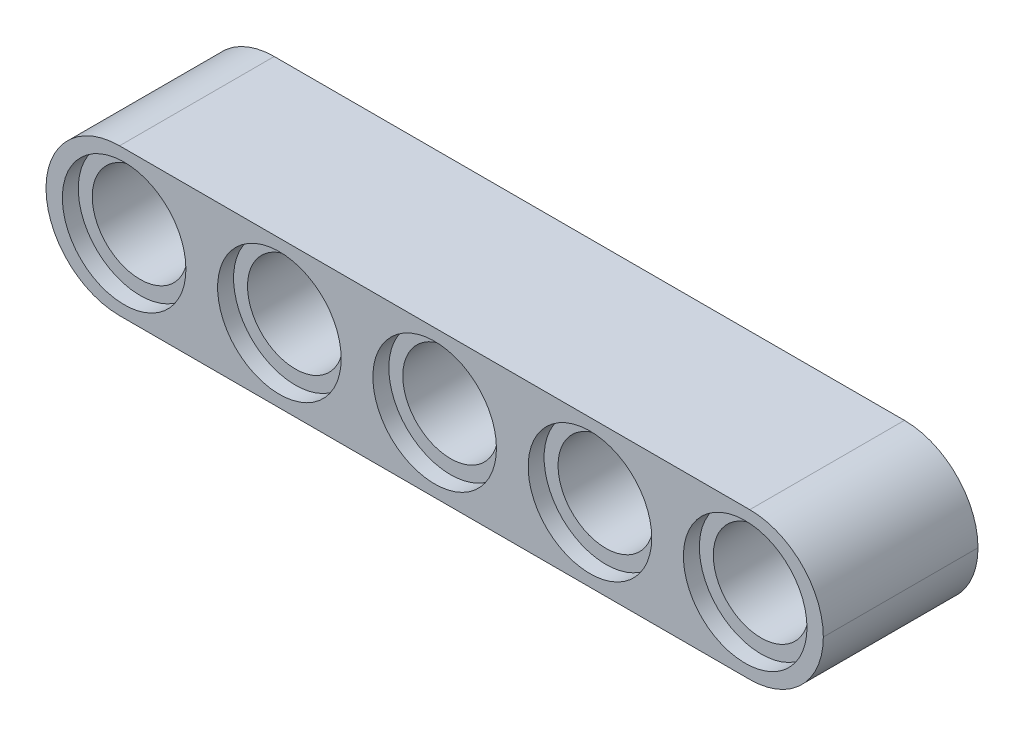
ISO-10303-21;
HEADER;
FILE_DESCRIPTION(('STEP AP214'),'2;1');
FILE_NAME('part.step','',(''),(''),'','','');
FILE_SCHEMA(('AUTOMOTIVE_DESIGN { 1 0 10303 214 1 1 1 1 }'));
ENDSEC;
DATA;
#1=APPLICATION_CONTEXT('core data for automotive mechanical design processes');
#2=APPLICATION_PROTOCOL_DEFINITION('international standard','automotive_design',2000,#1);
#3=PRODUCT_CONTEXT('',#1,'mechanical');
#4=PRODUCT('Part','Part','',(#3));
#5=PRODUCT_RELATED_PRODUCT_CATEGORY('part','',(#4));
#6=PRODUCT_DEFINITION_FORMATION('','',#4);
#7=PRODUCT_DEFINITION_CONTEXT('part definition',#1,'design');
#8=PRODUCT_DEFINITION('design','',#6,#7);
#9=PRODUCT_DEFINITION_SHAPE('','',#8);
#10=(LENGTH_UNIT() NAMED_UNIT(*) SI_UNIT(.MILLI.,.METRE.));
#11=(NAMED_UNIT(*) PLANE_ANGLE_UNIT() SI_UNIT($,.RADIAN.));
#12=(NAMED_UNIT(*) SI_UNIT($,.STERADIAN.) SOLID_ANGLE_UNIT());
#13=UNCERTAINTY_MEASURE_WITH_UNIT(LENGTH_MEASURE(1.E-05),#10,'distance_accuracy_value','');
#14=(GEOMETRIC_REPRESENTATION_CONTEXT(3) GLOBAL_UNCERTAINTY_ASSIGNED_CONTEXT((#13)) GLOBAL_UNIT_ASSIGNED_CONTEXT((#10,
#11,#12)) REPRESENTATION_CONTEXT('',''));
#15=CARTESIAN_POINT('',(0.,0.,0.));
#16=DIRECTION('',(0.,0.,1.));
#17=DIRECTION('',(1.,0.,0.));
#18=AXIS2_PLACEMENT_3D('',#15,#16,#17);
#19=CARTESIAN_POINT('',(35.31,3.69,7.76));
#20=DIRECTION('',(0.,0.,1.));
#21=DIRECTION('',(1.,0.,0.));
#22=AXIS2_PLACEMENT_3D('',#19,#20,#21);
#23=CYLINDRICAL_SURFACE('',#22,3.69);
#24=DIRECTION('',(0.,0.,1.));
#25=VECTOR('',#24,1.);
#26=CARTESIAN_POINT('',(35.31,0.,7.76));
#27=LINE('',#26,#25);
#28=CARTESIAN_POINT('',(35.31,0.,0.));
#29=VERTEX_POINT('',#28);
#30=CARTESIAN_POINT('',(35.31,0.,7.76));
#31=VERTEX_POINT('',#30);
#32=EDGE_CURVE('E134',#29,#31,#27,.T.);
#33=ORIENTED_EDGE('',*,*,#32,.F.);
#34=CARTESIAN_POINT('',(35.31,3.69,0.));
#35=DIRECTION('',(0.,0.,-1.));
#36=DIRECTION('',(-1.,0.,0.));
#37=AXIS2_PLACEMENT_3D('',#34,#35,#36);
#38=CIRCLE('',#37,3.69);
#39=CARTESIAN_POINT('',(39.,3.69,0.));
#40=VERTEX_POINT('',#39);
#41=EDGE_CURVE('E44',#40,#29,#38,.T.);
#42=ORIENTED_EDGE('',*,*,#41,.F.);
#43=DIRECTION('',(0.,0.,1.));
#44=VECTOR('',#43,1.);
#45=CARTESIAN_POINT('',(39.,3.69,7.76));
#46=LINE('',#45,#44);
#47=CARTESIAN_POINT('',(39.,3.69,7.76));
#48=VERTEX_POINT('',#47);
#49=EDGE_CURVE('E127',#40,#48,#46,.T.);
#50=ORIENTED_EDGE('',*,*,#49,.T.);
#51=CARTESIAN_POINT('',(35.31,3.69,7.76));
#52=DIRECTION('',(0.,0.,-1.));
#53=DIRECTION('',(-1.,0.,0.));
#54=AXIS2_PLACEMENT_3D('',#51,#52,#53);
#55=CIRCLE('',#54,3.69);
#56=EDGE_CURVE('E12',#31,#48,#55,.F.);
#57=ORIENTED_EDGE('',*,*,#56,.F.);
#58=EDGE_LOOP('',(#33,#42,#50,#57));
#59=FACE_BOUND('',#58,.T.);
#60=ADVANCED_FACE('F37',(#59),#23,.T.);
#61=CARTESIAN_POINT('',(35.31,3.69,7.76));
#62=DIRECTION('',(0.,0.,1.));
#63=DIRECTION('',(1.,0.,0.));
#64=AXIS2_PLACEMENT_3D('',#61,#62,#63);
#65=CYLINDRICAL_SURFACE('',#64,3.69);
#66=ORIENTED_EDGE('',*,*,#49,.F.);
#67=CARTESIAN_POINT('',(35.31,3.69,0.));
#68=DIRECTION('',(0.,0.,-1.));
#69=DIRECTION('',(-1.,0.,0.));
#70=AXIS2_PLACEMENT_3D('',#67,#68,#69);
#71=CIRCLE('',#70,3.69);
#72=CARTESIAN_POINT('',(35.31,7.38,0.));
#73=VERTEX_POINT('',#72);
#74=EDGE_CURVE('E130',#73,#40,#71,.T.);
#75=ORIENTED_EDGE('',*,*,#74,.F.);
#76=DIRECTION('',(0.,0.,1.));
#77=VECTOR('',#76,1.);
#78=CARTESIAN_POINT('',(35.31,7.38,7.76));
#79=LINE('',#78,#77);
#80=CARTESIAN_POINT('',(35.31,7.38,7.76));
#81=VERTEX_POINT('',#80);
#82=EDGE_CURVE('E95',#81,#73,#79,.F.);
#83=ORIENTED_EDGE('',*,*,#82,.F.);
#84=CARTESIAN_POINT('',(35.31,3.69,7.76));
#85=DIRECTION('',(0.,0.,-1.));
#86=DIRECTION('',(-1.,0.,0.));
#87=AXIS2_PLACEMENT_3D('',#84,#85,#86);
#88=CIRCLE('',#87,3.69);
#89=EDGE_CURVE('E132',#48,#81,#88,.F.);
#90=ORIENTED_EDGE('',*,*,#89,.F.);
#91=EDGE_LOOP('',(#66,#75,#83,#90));
#92=FACE_BOUND('',#91,.T.);
#93=ADVANCED_FACE('F253',(#92),#65,.T.);
#94=CARTESIAN_POINT('',(3.69,3.69,7.76));
#95=DIRECTION('',(0.,0.,-1.));
#96=DIRECTION('',(-1.,0.,0.));
#97=AXIS2_PLACEMENT_3D('',#94,#95,#96);
#98=CYLINDRICAL_SURFACE('',#97,3.69);
#99=DIRECTION('',(0.,0.,-1.));
#100=VECTOR('',#99,1.);
#101=CARTESIAN_POINT('',(3.69,0.,7.76));
#102=LINE('',#101,#100);
#103=CARTESIAN_POINT('',(3.69,0.,7.76));
#104=VERTEX_POINT('',#103);
#105=CARTESIAN_POINT('',(3.69,0.,0.));
#106=VERTEX_POINT('',#105);
#107=EDGE_CURVE('E121',#104,#106,#102,.T.);
#108=ORIENTED_EDGE('',*,*,#107,.F.);
#109=CARTESIAN_POINT('',(3.69,3.69,7.76));
#110=DIRECTION('',(0.,0.,-1.));
#111=DIRECTION('',(-1.,0.,0.));
#112=AXIS2_PLACEMENT_3D('',#109,#110,#111);
#113=CIRCLE('',#112,3.69);
#114=CARTESIAN_POINT('',(0.,3.69,7.76));
#115=VERTEX_POINT('',#114);
#116=EDGE_CURVE('E124',#115,#104,#113,.F.);
#117=ORIENTED_EDGE('',*,*,#116,.F.);
#118=DIRECTION('',(0.,0.,1.));
#119=VECTOR('',#118,1.);
#120=CARTESIAN_POINT('',(0.,3.69,7.76));
#121=LINE('',#120,#119);
#122=CARTESIAN_POINT('',(0.,3.69,0.));
#123=VERTEX_POINT('',#122);
#124=EDGE_CURVE('E107',#115,#123,#121,.F.);
#125=ORIENTED_EDGE('',*,*,#124,.T.);
#126=CARTESIAN_POINT('',(3.69,3.69,0.));
#127=DIRECTION('',(0.,0.,-1.));
#128=DIRECTION('',(-1.,0.,0.));
#129=AXIS2_PLACEMENT_3D('',#126,#127,#128);
#130=CIRCLE('',#129,3.69);
#131=EDGE_CURVE('E102',#106,#123,#130,.T.);
#132=ORIENTED_EDGE('',*,*,#131,.F.);
#133=EDGE_LOOP('',(#108,#117,#125,#132));
#134=FACE_BOUND('',#133,.T.);
#135=ADVANCED_FACE('F257',(#134),#98,.T.);
#136=CARTESIAN_POINT('',(3.69,3.69,7.76));
#137=DIRECTION('',(0.,0.,1.));
#138=DIRECTION('',(1.,0.,0.));
#139=AXIS2_PLACEMENT_3D('',#136,#137,#138);
#140=CYLINDRICAL_SURFACE('',#139,3.69);
#141=DIRECTION('',(0.,0.,1.));
#142=VECTOR('',#141,1.);
#143=CARTESIAN_POINT('',(3.69,7.38,7.76));
#144=LINE('',#143,#142);
#145=CARTESIAN_POINT('',(3.69,7.38,0.));
#146=VERTEX_POINT('',#145);
#147=CARTESIAN_POINT('',(3.69,7.38,7.76));
#148=VERTEX_POINT('',#147);
#149=EDGE_CURVE('E93',#146,#148,#144,.T.);
#150=ORIENTED_EDGE('',*,*,#149,.F.);
#151=CARTESIAN_POINT('',(3.69,3.69,0.));
#152=DIRECTION('',(0.,0.,-1.));
#153=DIRECTION('',(-1.,0.,0.));
#154=AXIS2_PLACEMENT_3D('',#151,#152,#153);
#155=CIRCLE('',#154,3.69);
#156=EDGE_CURVE('E100',#123,#146,#155,.T.);
#157=ORIENTED_EDGE('',*,*,#156,.F.);
#158=ORIENTED_EDGE('',*,*,#124,.F.);
#159=CARTESIAN_POINT('',(3.69,3.69,7.76));
#160=DIRECTION('',(0.,0.,-1.));
#161=DIRECTION('',(-1.,0.,0.));
#162=AXIS2_PLACEMENT_3D('',#159,#160,#161);
#163=CIRCLE('',#162,3.69);
#164=EDGE_CURVE('E106',#148,#115,#163,.F.);
#165=ORIENTED_EDGE('',*,*,#164,.F.);
#166=EDGE_LOOP('',(#150,#157,#158,#165));
#167=FACE_BOUND('',#166,.T.);
#168=ADVANCED_FACE('F110',(#167),#140,.T.);
#169=CARTESIAN_POINT('',(35.08,3.69,0.));
#170=DIRECTION('',(0.,0.,1.));
#171=DIRECTION('',(1.,0.,0.));
#172=AXIS2_PLACEMENT_3D('',#169,#170,#171);
#173=CYLINDRICAL_SURFACE('',#172,3.1);
#174=CARTESIAN_POINT('',(35.08,3.69,0.));
#175=DIRECTION('',(0.,0.,1.));
#176=DIRECTION('',(1.,0.,0.));
#177=AXIS2_PLACEMENT_3D('',#174,#175,#176);
#178=CIRCLE('',#177,3.1);
#179=CARTESIAN_POINT('',(38.18,3.69,0.));
#180=VERTEX_POINT('',#179);
#181=EDGE_CURVE('E112',#180,#180,#178,.T.);
#182=ORIENTED_EDGE('',*,*,#181,.F.);
#183=EDGE_LOOP('',(#182));
#184=FACE_BOUND('',#183,.T.);
#185=CARTESIAN_POINT('',(35.08,3.69,0.8));
#186=DIRECTION('',(0.,0.,1.));
#187=DIRECTION('',(1.,0.,0.));
#188=AXIS2_PLACEMENT_3D('',#185,#186,#187);
#189=CIRCLE('',#188,3.1);
#190=CARTESIAN_POINT('',(38.18,3.69,0.8));
#191=VERTEX_POINT('',#190);
#192=EDGE_CURVE('E116',#191,#191,#189,.T.);
#193=ORIENTED_EDGE('',*,*,#192,.T.);
#194=EDGE_LOOP('',(#193));
#195=FACE_BOUND('',#194,.T.);
#196=ADVANCED_FACE('F228',(#184,#195),#173,.F.);
#197=CARTESIAN_POINT('',(15.58,0.,0.8));
#198=DIRECTION('',(0.,0.,1.));
#199=DIRECTION('',(1.,0.,0.));
#200=AXIS2_PLACEMENT_3D('',#197,#198,#199);
#201=PLANE('',#200);
#202=ORIENTED_EDGE('',*,*,#192,.F.);
#203=EDGE_LOOP('',(#202));
#204=FACE_BOUND('',#203,.T.);
#205=CARTESIAN_POINT('',(35.08,3.69,0.8));
#206=DIRECTION('',(0.,0.,1.));
#207=DIRECTION('',(1.,0.,0.));
#208=AXIS2_PLACEMENT_3D('',#205,#206,#207);
#209=CIRCLE('',#208,2.4);
#210=CARTESIAN_POINT('',(37.48,3.69,0.8));
#211=VERTEX_POINT('',#210);
#212=EDGE_CURVE('E217',#211,#211,#209,.F.);
#213=ORIENTED_EDGE('',*,*,#212,.F.);
#214=EDGE_LOOP('',(#213));
#215=FACE_BOUND('',#214,.T.);
#216=ADVANCED_FACE('F230',(#204,#215),#201,.F.);
#217=CARTESIAN_POINT('',(15.58,0.,6.95999999999999));
#218=DIRECTION('',(0.,0.,-1.));
#219=DIRECTION('',(-1.,0.,0.));
#220=AXIS2_PLACEMENT_3D('',#217,#218,#219);
#221=PLANE('',#220);
#222=CARTESIAN_POINT('',(35.08,3.69,6.96));
#223=DIRECTION('',(0.,0.,1.));
#224=DIRECTION('',(1.,0.,0.));
#225=AXIS2_PLACEMENT_3D('',#222,#223,#224);
#226=CIRCLE('',#225,3.1);
#227=CARTESIAN_POINT('',(38.18,3.69,6.96));
#228=VERTEX_POINT('',#227);
#229=EDGE_CURVE('E223',#228,#228,#226,.T.);
#230=ORIENTED_EDGE('',*,*,#229,.T.);
#231=EDGE_LOOP('',(#230));
#232=FACE_BOUND('',#231,.T.);
#233=CARTESIAN_POINT('',(35.08,3.69,6.95999999999999));
#234=DIRECTION('',(0.,0.,-1.));
#235=DIRECTION('',(-1.,0.,0.));
#236=AXIS2_PLACEMENT_3D('',#233,#234,#235);
#237=CIRCLE('',#236,2.4);
#238=CARTESIAN_POINT('',(32.68,3.69,6.95999999999999));
#239=VERTEX_POINT('',#238);
#240=EDGE_CURVE('E214',#239,#239,#237,.F.);
#241=ORIENTED_EDGE('',*,*,#240,.F.);
#242=EDGE_LOOP('',(#241));
#243=FACE_BOUND('',#242,.T.);
#244=ADVANCED_FACE('F233',(#232,#243),#221,.F.);
#245=CARTESIAN_POINT('',(35.08,3.69,7.76));
#246=DIRECTION('',(0.,0.,-1.));
#247=DIRECTION('',(-1.,0.,0.));
#248=AXIS2_PLACEMENT_3D('',#245,#246,#247);
#249=CYLINDRICAL_SURFACE('',#248,3.1);
#250=CARTESIAN_POINT('',(35.08,3.69,7.76));
#251=DIRECTION('',(0.,0.,1.));
#252=DIRECTION('',(1.,0.,0.));
#253=AXIS2_PLACEMENT_3D('',#250,#251,#252);
#254=CIRCLE('',#253,3.1);
#255=CARTESIAN_POINT('',(38.18,3.69,7.76));
#256=VERTEX_POINT('',#255);
#257=EDGE_CURVE('E220',#256,#256,#254,.T.);
#258=ORIENTED_EDGE('',*,*,#257,.T.);
#259=EDGE_LOOP('',(#258));
#260=FACE_BOUND('',#259,.T.);
#261=ORIENTED_EDGE('',*,*,#229,.F.);
#262=EDGE_LOOP('',(#261));
#263=FACE_BOUND('',#262,.T.);
#264=ADVANCED_FACE('F240',(#260,#263),#249,.F.);
#265=CARTESIAN_POINT('',(35.08,3.69,0.));
#266=DIRECTION('',(0.,0.,1.));
#267=DIRECTION('',(1.,0.,0.));
#268=AXIS2_PLACEMENT_3D('',#265,#266,#267);
#269=CYLINDRICAL_SURFACE('',#268,2.4);
#270=ORIENTED_EDGE('',*,*,#240,.T.);
#271=EDGE_LOOP('',(#270));
#272=FACE_BOUND('',#271,.T.);
#273=ORIENTED_EDGE('',*,*,#212,.T.);
#274=EDGE_LOOP('',(#273));
#275=FACE_BOUND('',#274,.T.);
#276=ADVANCED_FACE('F237',(#272,#275),#269,.F.);
#277=CARTESIAN_POINT('',(27.29,3.69,0.));
#278=DIRECTION('',(0.,0.,1.));
#279=DIRECTION('',(1.,0.,0.));
#280=AXIS2_PLACEMENT_3D('',#277,#278,#279);
#281=CYLINDRICAL_SURFACE('',#280,3.1);
#282=CARTESIAN_POINT('',(27.29,3.69,0.));
#283=DIRECTION('',(0.,0.,1.));
#284=DIRECTION('',(1.,0.,0.));
#285=AXIS2_PLACEMENT_3D('',#282,#283,#284);
#286=CIRCLE('',#285,3.1);
#287=CARTESIAN_POINT('',(30.39,3.69,0.));
#288=VERTEX_POINT('',#287);
#289=EDGE_CURVE('E211',#288,#288,#286,.T.);
#290=ORIENTED_EDGE('',*,*,#289,.F.);
#291=EDGE_LOOP('',(#290));
#292=FACE_BOUND('',#291,.T.);
#293=CARTESIAN_POINT('',(27.29,3.69,0.8));
#294=DIRECTION('',(0.,0.,1.));
#295=DIRECTION('',(1.,0.,0.));
#296=AXIS2_PLACEMENT_3D('',#293,#294,#295);
#297=CIRCLE('',#296,3.1);
#298=CARTESIAN_POINT('',(30.39,3.69,0.8));
#299=VERTEX_POINT('',#298);
#300=EDGE_CURVE('E208',#299,#299,#297,.T.);
#301=ORIENTED_EDGE('',*,*,#300,.T.);
#302=EDGE_LOOP('',(#301));
#303=FACE_BOUND('',#302,.T.);
#304=ADVANCED_FACE('F239',(#292,#303),#281,.F.);
#305=CARTESIAN_POINT('',(7.79,0.,0.8));
#306=DIRECTION('',(0.,0.,1.));
#307=DIRECTION('',(1.,0.,0.));
#308=AXIS2_PLACEMENT_3D('',#305,#306,#307);
#309=PLANE('',#308);
#310=ORIENTED_EDGE('',*,*,#300,.F.);
#311=EDGE_LOOP('',(#310));
#312=FACE_BOUND('',#311,.T.);
#313=CARTESIAN_POINT('',(27.29,3.69,0.8));
#314=DIRECTION('',(0.,0.,1.));
#315=DIRECTION('',(1.,0.,0.));
#316=AXIS2_PLACEMENT_3D('',#313,#314,#315);
#317=CIRCLE('',#316,2.4);
#318=CARTESIAN_POINT('',(29.69,3.69,0.8));
#319=VERTEX_POINT('',#318);
#320=EDGE_CURVE('E199',#319,#319,#317,.F.);
#321=ORIENTED_EDGE('',*,*,#320,.F.);
#322=EDGE_LOOP('',(#321));
#323=FACE_BOUND('',#322,.T.);
#324=ADVANCED_FACE('F247',(#312,#323),#309,.F.);
#325=CARTESIAN_POINT('',(7.79,0.,6.95999999999999));
#326=DIRECTION('',(0.,0.,-1.));
#327=DIRECTION('',(-1.,0.,0.));
#328=AXIS2_PLACEMENT_3D('',#325,#326,#327);
#329=PLANE('',#328);
#330=CARTESIAN_POINT('',(27.29,3.69,6.96));
#331=DIRECTION('',(0.,0.,1.));
#332=DIRECTION('',(1.,0.,0.));
#333=AXIS2_PLACEMENT_3D('',#330,#331,#332);
#334=CIRCLE('',#333,3.1);
#335=CARTESIAN_POINT('',(30.39,3.69,6.96));
#336=VERTEX_POINT('',#335);
#337=EDGE_CURVE('E205',#336,#336,#334,.T.);
#338=ORIENTED_EDGE('',*,*,#337,.T.);
#339=EDGE_LOOP('',(#338));
#340=FACE_BOUND('',#339,.T.);
#341=CARTESIAN_POINT('',(27.29,3.69,6.95999999999999));
#342=DIRECTION('',(0.,0.,-1.));
#343=DIRECTION('',(-1.,0.,0.));
#344=AXIS2_PLACEMENT_3D('',#341,#342,#343);
#345=CIRCLE('',#344,2.4);
#346=CARTESIAN_POINT('',(24.89,3.69,6.95999999999999));
#347=VERTEX_POINT('',#346);
#348=EDGE_CURVE('E196',#347,#347,#345,.F.);
#349=ORIENTED_EDGE('',*,*,#348,.F.);
#350=EDGE_LOOP('',(#349));
#351=FACE_BOUND('',#350,.T.);
#352=ADVANCED_FACE('F304',(#340,#351),#329,.F.);
#353=CARTESIAN_POINT('',(27.29,3.69,7.76));
#354=DIRECTION('',(0.,0.,-1.));
#355=DIRECTION('',(-1.,0.,0.));
#356=AXIS2_PLACEMENT_3D('',#353,#354,#355);
#357=CYLINDRICAL_SURFACE('',#356,3.1);
#358=CARTESIAN_POINT('',(27.29,3.69,7.76));
#359=DIRECTION('',(0.,0.,1.));
#360=DIRECTION('',(1.,0.,0.));
#361=AXIS2_PLACEMENT_3D('',#358,#359,#360);
#362=CIRCLE('',#361,3.1);
#363=CARTESIAN_POINT('',(30.39,3.69,7.76));
#364=VERTEX_POINT('',#363);
#365=EDGE_CURVE('E202',#364,#364,#362,.T.);
#366=ORIENTED_EDGE('',*,*,#365,.T.);
#367=EDGE_LOOP('',(#366));
#368=FACE_BOUND('',#367,.T.);
#369=ORIENTED_EDGE('',*,*,#337,.F.);
#370=EDGE_LOOP('',(#369));
#371=FACE_BOUND('',#370,.T.);
#372=ADVANCED_FACE('F314',(#368,#371),#357,.F.);
#373=CARTESIAN_POINT('',(27.29,3.69,0.));
#374=DIRECTION('',(0.,0.,1.));
#375=DIRECTION('',(1.,0.,0.));
#376=AXIS2_PLACEMENT_3D('',#373,#374,#375);
#377=CYLINDRICAL_SURFACE('',#376,2.4);
#378=ORIENTED_EDGE('',*,*,#348,.T.);
#379=EDGE_LOOP('',(#378));
#380=FACE_BOUND('',#379,.T.);
#381=ORIENTED_EDGE('',*,*,#320,.T.);
#382=EDGE_LOOP('',(#381));
#383=FACE_BOUND('',#382,.T.);
#384=ADVANCED_FACE('F324',(#380,#383),#377,.F.);
#385=CARTESIAN_POINT('',(3.92,3.69,7.76));
#386=DIRECTION('',(0.,0.,-1.));
#387=DIRECTION('',(-1.,0.,0.));
#388=AXIS2_PLACEMENT_3D('',#385,#386,#387);
#389=CYLINDRICAL_SURFACE('',#388,3.1);
#390=CARTESIAN_POINT('',(3.92,3.69,7.76));
#391=DIRECTION('',(0.,0.,1.));
#392=DIRECTION('',(1.,0.,0.));
#393=AXIS2_PLACEMENT_3D('',#390,#391,#392);
#394=CIRCLE('',#393,3.1);
#395=CARTESIAN_POINT('',(7.02,3.69,7.76));
#396=VERTEX_POINT('',#395);
#397=EDGE_CURVE('E193',#396,#396,#394,.T.);
#398=ORIENTED_EDGE('',*,*,#397,.T.);
#399=EDGE_LOOP('',(#398));
#400=FACE_BOUND('',#399,.T.);
#401=CARTESIAN_POINT('',(3.92,3.69,6.96));
#402=DIRECTION('',(0.,0.,1.));
#403=DIRECTION('',(1.,0.,0.));
#404=AXIS2_PLACEMENT_3D('',#401,#402,#403);
#405=CIRCLE('',#404,3.1);
#406=CARTESIAN_POINT('',(7.02,3.69,6.96));
#407=VERTEX_POINT('',#406);
#408=EDGE_CURVE('E184',#407,#407,#405,.T.);
#409=ORIENTED_EDGE('',*,*,#408,.F.);
#410=EDGE_LOOP('',(#409));
#411=FACE_BOUND('',#410,.T.);
#412=ADVANCED_FACE('F334',(#400,#411),#389,.F.);
#413=CARTESIAN_POINT('',(-15.58,0.,0.8));
#414=DIRECTION('',(0.,0.,1.));
#415=DIRECTION('',(1.,0.,0.));
#416=AXIS2_PLACEMENT_3D('',#413,#414,#415);
#417=PLANE('',#416);
#418=CARTESIAN_POINT('',(3.92,3.69,0.8));
#419=DIRECTION('',(0.,0.,1.));
#420=DIRECTION('',(1.,0.,0.));
#421=AXIS2_PLACEMENT_3D('',#418,#419,#420);
#422=CIRCLE('',#421,3.1);
#423=CARTESIAN_POINT('',(7.02,3.69,0.8));
#424=VERTEX_POINT('',#423);
#425=EDGE_CURVE('E190',#424,#424,#422,.T.);
#426=ORIENTED_EDGE('',*,*,#425,.F.);
#427=EDGE_LOOP('',(#426));
#428=FACE_BOUND('',#427,.T.);
#429=CARTESIAN_POINT('',(3.92,3.69,0.8));
#430=DIRECTION('',(0.,0.,1.));
#431=DIRECTION('',(1.,0.,0.));
#432=AXIS2_PLACEMENT_3D('',#429,#430,#431);
#433=CIRCLE('',#432,2.4);
#434=CARTESIAN_POINT('',(6.32,3.69,0.8));
#435=VERTEX_POINT('',#434);
#436=EDGE_CURVE('E181',#435,#435,#433,.F.);
#437=ORIENTED_EDGE('',*,*,#436,.F.);
#438=EDGE_LOOP('',(#437));
#439=FACE_BOUND('',#438,.T.);
#440=ADVANCED_FACE('F442',(#428,#439),#417,.F.);
#441=CARTESIAN_POINT('',(3.92,3.69,0.));
#442=DIRECTION('',(0.,0.,1.));
#443=DIRECTION('',(1.,0.,0.));
#444=AXIS2_PLACEMENT_3D('',#441,#442,#443);
#445=CYLINDRICAL_SURFACE('',#444,3.1);
#446=CARTESIAN_POINT('',(3.92,3.69,0.));
#447=DIRECTION('',(0.,0.,1.));
#448=DIRECTION('',(1.,0.,0.));
#449=AXIS2_PLACEMENT_3D('',#446,#447,#448);
#450=CIRCLE('',#449,3.1);
#451=CARTESIAN_POINT('',(7.02,3.69,0.));
#452=VERTEX_POINT('',#451);
#453=EDGE_CURVE('E187',#452,#452,#450,.T.);
#454=ORIENTED_EDGE('',*,*,#453,.F.);
#455=EDGE_LOOP('',(#454));
#456=FACE_BOUND('',#455,.T.);
#457=ORIENTED_EDGE('',*,*,#425,.T.);
#458=EDGE_LOOP('',(#457));
#459=FACE_BOUND('',#458,.T.);
#460=ADVANCED_FACE('F452',(#456,#459),#445,.F.);
#461=CARTESIAN_POINT('',(-15.58,0.,6.95999999999999));
#462=DIRECTION('',(0.,0.,-1.));
#463=DIRECTION('',(-1.,0.,0.));
#464=AXIS2_PLACEMENT_3D('',#461,#462,#463);
#465=PLANE('',#464);
#466=ORIENTED_EDGE('',*,*,#408,.T.);
#467=EDGE_LOOP('',(#466));
#468=FACE_BOUND('',#467,.T.);
#469=CARTESIAN_POINT('',(3.92,3.69,6.95999999999999));
#470=DIRECTION('',(0.,0.,-1.));
#471=DIRECTION('',(-1.,0.,0.));
#472=AXIS2_PLACEMENT_3D('',#469,#470,#471);
#473=CIRCLE('',#472,2.4);
#474=CARTESIAN_POINT('',(1.52,3.69,6.95999999999999));
#475=VERTEX_POINT('',#474);
#476=EDGE_CURVE('E178',#475,#475,#473,.F.);
#477=ORIENTED_EDGE('',*,*,#476,.F.);
#478=EDGE_LOOP('',(#477));
#479=FACE_BOUND('',#478,.T.);
#480=ADVANCED_FACE('F462',(#468,#479),#465,.F.);
#481=CARTESIAN_POINT('',(3.92,3.69,0.));
#482=DIRECTION('',(0.,0.,1.));
#483=DIRECTION('',(1.,0.,0.));
#484=AXIS2_PLACEMENT_3D('',#481,#482,#483);
#485=CYLINDRICAL_SURFACE('',#484,2.4);
#486=ORIENTED_EDGE('',*,*,#476,.T.);
#487=EDGE_LOOP('',(#486));
#488=FACE_BOUND('',#487,.T.);
#489=ORIENTED_EDGE('',*,*,#436,.T.);
#490=EDGE_LOOP('',(#489));
#491=FACE_BOUND('',#490,.T.);
#492=ADVANCED_FACE('F472',(#488,#491),#485,.F.);
#493=CARTESIAN_POINT('',(11.71,3.69,7.76));
#494=DIRECTION('',(0.,0.,-1.));
#495=DIRECTION('',(-1.,0.,0.));
#496=AXIS2_PLACEMENT_3D('',#493,#494,#495);
#497=CYLINDRICAL_SURFACE('',#496,3.1);
#498=CARTESIAN_POINT('',(11.71,3.69,7.76));
#499=DIRECTION('',(0.,0.,1.));
#500=DIRECTION('',(1.,0.,0.));
#501=AXIS2_PLACEMENT_3D('',#498,#499,#500);
#502=CIRCLE('',#501,3.1);
#503=CARTESIAN_POINT('',(14.81,3.69,7.76));
#504=VERTEX_POINT('',#503);
#505=EDGE_CURVE('E175',#504,#504,#502,.T.);
#506=ORIENTED_EDGE('',*,*,#505,.T.);
#507=EDGE_LOOP('',(#506));
#508=FACE_BOUND('',#507,.T.);
#509=CARTESIAN_POINT('',(11.71,3.69,6.96));
#510=DIRECTION('',(0.,0.,1.));
#511=DIRECTION('',(1.,0.,0.));
#512=AXIS2_PLACEMENT_3D('',#509,#510,#511);
#513=CIRCLE('',#512,3.1);
#514=CARTESIAN_POINT('',(14.81,3.69,6.96));
#515=VERTEX_POINT('',#514);
#516=EDGE_CURVE('E166',#515,#515,#513,.T.);
#517=ORIENTED_EDGE('',*,*,#516,.F.);
#518=EDGE_LOOP('',(#517));
#519=FACE_BOUND('',#518,.T.);
#520=ADVANCED_FACE('F482',(#508,#519),#497,.F.);
#521=CARTESIAN_POINT('',(-7.79,0.,0.8));
#522=DIRECTION('',(0.,0.,1.));
#523=DIRECTION('',(1.,0.,0.));
#524=AXIS2_PLACEMENT_3D('',#521,#522,#523);
#525=PLANE('',#524);
#526=CARTESIAN_POINT('',(11.71,3.69,0.8));
#527=DIRECTION('',(0.,0.,1.));
#528=DIRECTION('',(1.,0.,0.));
#529=AXIS2_PLACEMENT_3D('',#526,#527,#528);
#530=CIRCLE('',#529,3.1);
#531=CARTESIAN_POINT('',(14.81,3.69,0.8));
#532=VERTEX_POINT('',#531);
#533=EDGE_CURVE('E172',#532,#532,#530,.T.);
#534=ORIENTED_EDGE('',*,*,#533,.F.);
#535=EDGE_LOOP('',(#534));
#536=FACE_BOUND('',#535,.T.);
#537=CARTESIAN_POINT('',(11.71,3.69,0.8));
#538=DIRECTION('',(0.,0.,1.));
#539=DIRECTION('',(1.,0.,0.));
#540=AXIS2_PLACEMENT_3D('',#537,#538,#539);
#541=CIRCLE('',#540,2.4);
#542=CARTESIAN_POINT('',(14.11,3.69,0.8));
#543=VERTEX_POINT('',#542);
#544=EDGE_CURVE('E163',#543,#543,#541,.F.);
#545=ORIENTED_EDGE('',*,*,#544,.F.);
#546=EDGE_LOOP('',(#545));
#547=FACE_BOUND('',#546,.T.);
#548=ADVANCED_FACE('F492',(#536,#547),#525,.F.);
#549=CARTESIAN_POINT('',(11.71,3.69,0.));
#550=DIRECTION('',(0.,0.,1.));
#551=DIRECTION('',(1.,0.,0.));
#552=AXIS2_PLACEMENT_3D('',#549,#550,#551);
#553=CYLINDRICAL_SURFACE('',#552,3.1);
#554=CARTESIAN_POINT('',(11.71,3.69,0.));
#555=DIRECTION('',(0.,0.,1.));
#556=DIRECTION('',(1.,0.,0.));
#557=AXIS2_PLACEMENT_3D('',#554,#555,#556);
#558=CIRCLE('',#557,3.1);
#559=CARTESIAN_POINT('',(14.81,3.69,0.));
#560=VERTEX_POINT('',#559);
#561=EDGE_CURVE('E169',#560,#560,#558,.T.);
#562=ORIENTED_EDGE('',*,*,#561,.F.);
#563=EDGE_LOOP('',(#562));
#564=FACE_BOUND('',#563,.T.);
#565=ORIENTED_EDGE('',*,*,#533,.T.);
#566=EDGE_LOOP('',(#565));
#567=FACE_BOUND('',#566,.T.);
#568=ADVANCED_FACE('F502',(#564,#567),#553,.F.);
#569=CARTESIAN_POINT('',(-7.79,0.,6.95999999999999));
#570=DIRECTION('',(0.,0.,-1.));
#571=DIRECTION('',(-1.,0.,0.));
#572=AXIS2_PLACEMENT_3D('',#569,#570,#571);
#573=PLANE('',#572);
#574=ORIENTED_EDGE('',*,*,#516,.T.);
#575=EDGE_LOOP('',(#574));
#576=FACE_BOUND('',#575,.T.);
#577=CARTESIAN_POINT('',(11.71,3.69,6.95999999999999));
#578=DIRECTION('',(0.,0.,-1.));
#579=DIRECTION('',(-1.,0.,0.));
#580=AXIS2_PLACEMENT_3D('',#577,#578,#579);
#581=CIRCLE('',#580,2.4);
#582=CARTESIAN_POINT('',(9.31,3.69,6.95999999999999));
#583=VERTEX_POINT('',#582);
#584=EDGE_CURVE('E146',#583,#583,#581,.F.);
#585=ORIENTED_EDGE('',*,*,#584,.F.);
#586=EDGE_LOOP('',(#585));
#587=FACE_BOUND('',#586,.T.);
#588=ADVANCED_FACE('F512',(#576,#587),#573,.F.);
#589=CARTESIAN_POINT('',(11.71,3.69,0.));
#590=DIRECTION('',(0.,0.,1.));
#591=DIRECTION('',(1.,0.,0.));
#592=AXIS2_PLACEMENT_3D('',#589,#590,#591);
#593=CYLINDRICAL_SURFACE('',#592,2.4);
#594=ORIENTED_EDGE('',*,*,#584,.T.);
#595=EDGE_LOOP('',(#594));
#596=FACE_BOUND('',#595,.T.);
#597=ORIENTED_EDGE('',*,*,#544,.T.);
#598=EDGE_LOOP('',(#597));
#599=FACE_BOUND('',#598,.T.);
#600=ADVANCED_FACE('F375',(#596,#599),#593,.F.);
#601=CARTESIAN_POINT('',(0.,0.,7.76));
#602=DIRECTION('',(0.,1.,0.));
#603=DIRECTION('',(0.,0.,1.));
#604=AXIS2_PLACEMENT_3D('',#601,#602,#603);
#605=PLANE('',#604);
#606=DIRECTION('',(1.,0.,0.));
#607=VECTOR('',#606,1.);
#608=CARTESIAN_POINT('',(0.,0.,0.));
#609=LINE('',#608,#607);
#610=EDGE_CURVE('E97',#106,#29,#609,.T.);
#611=ORIENTED_EDGE('',*,*,#610,.T.);
#612=ORIENTED_EDGE('',*,*,#32,.T.);
#613=DIRECTION('',(1.,0.,0.));
#614=VECTOR('',#613,1.);
#615=CARTESIAN_POINT('',(0.,0.,7.76));
#616=LINE('',#615,#614);
#617=EDGE_CURVE('E96',#104,#31,#616,.T.);
#618=ORIENTED_EDGE('',*,*,#617,.F.);
#619=ORIENTED_EDGE('',*,*,#107,.T.);
#620=EDGE_LOOP('',(#611,#612,#618,#619));
#621=FACE_BOUND('',#620,.T.);
#622=ADVANCED_FACE('F139',(#621),#605,.F.);
#623=CARTESIAN_POINT('',(0.,7.38,7.76));
#624=DIRECTION('',(0.,-1.,0.));
#625=DIRECTION('',(0.,0.,-1.));
#626=AXIS2_PLACEMENT_3D('',#623,#624,#625);
#627=PLANE('',#626);
#628=DIRECTION('',(-1.,0.,0.));
#629=VECTOR('',#628,1.);
#630=CARTESIAN_POINT('',(0.,7.38,7.76));
#631=LINE('',#630,#629);
#632=EDGE_CURVE('E144',#81,#148,#631,.T.);
#633=ORIENTED_EDGE('',*,*,#632,.F.);
#634=ORIENTED_EDGE('',*,*,#82,.T.);
#635=DIRECTION('',(-1.,0.,0.));
#636=VECTOR('',#635,1.);
#637=CARTESIAN_POINT('',(0.,7.38,0.));
#638=LINE('',#637,#636);
#639=EDGE_CURVE('E88',#73,#146,#638,.T.);
#640=ORIENTED_EDGE('',*,*,#639,.T.);
#641=ORIENTED_EDGE('',*,*,#149,.T.);
#642=EDGE_LOOP('',(#633,#634,#640,#641));
#643=FACE_BOUND('',#642,.T.);
#644=ADVANCED_FACE('F91',(#643),#627,.F.);
#645=CARTESIAN_POINT('',(0.,0.,7.76));
#646=DIRECTION('',(0.,0.,-1.));
#647=DIRECTION('',(-1.,0.,0.));
#648=AXIS2_PLACEMENT_3D('',#645,#646,#647);
#649=PLANE('',#648);
#650=ORIENTED_EDGE('',*,*,#257,.F.);
#651=EDGE_LOOP('',(#650));
#652=FACE_BOUND('',#651,.T.);
#653=ORIENTED_EDGE('',*,*,#365,.F.);
#654=EDGE_LOOP('',(#653));
#655=FACE_BOUND('',#654,.T.);
#656=ORIENTED_EDGE('',*,*,#397,.F.);
#657=EDGE_LOOP('',(#656));
#658=FACE_BOUND('',#657,.T.);
#659=ORIENTED_EDGE('',*,*,#505,.F.);
#660=EDGE_LOOP('',(#659));
#661=FACE_BOUND('',#660,.T.);
#662=CARTESIAN_POINT('',(19.5,3.69,7.76));
#663=DIRECTION('',(0.,0.,1.));
#664=DIRECTION('',(1.,0.,0.));
#665=AXIS2_PLACEMENT_3D('',#662,#663,#664);
#666=CIRCLE('',#665,3.1);
#667=CARTESIAN_POINT('',(22.6,3.69,7.76));
#668=VERTEX_POINT('',#667);
#669=EDGE_CURVE('E564',#668,#668,#666,.T.);
#670=ORIENTED_EDGE('',*,*,#669,.F.);
#671=EDGE_LOOP('',(#670));
#672=FACE_BOUND('',#671,.T.);
#673=ORIENTED_EDGE('',*,*,#617,.T.);
#674=ORIENTED_EDGE('',*,*,#56,.T.);
#675=ORIENTED_EDGE('',*,*,#89,.T.);
#676=ORIENTED_EDGE('',*,*,#632,.T.);
#677=ORIENTED_EDGE('',*,*,#164,.T.);
#678=ORIENTED_EDGE('',*,*,#116,.T.);
#679=EDGE_LOOP('',(#673,#674,#675,#676,#677,#678));
#680=FACE_BOUND('',#679,.T.);
#681=ADVANCED_FACE('F141',(#652,#655,#658,#661,#672,#680),#649,.F.);
#682=CARTESIAN_POINT('',(0.,0.,0.));
#683=DIRECTION('',(0.,0.,-1.));
#684=DIRECTION('',(-1.,0.,0.));
#685=AXIS2_PLACEMENT_3D('',#682,#683,#684);
#686=PLANE('',#685);
#687=ORIENTED_EDGE('',*,*,#181,.T.);
#688=EDGE_LOOP('',(#687));
#689=FACE_BOUND('',#688,.T.);
#690=ORIENTED_EDGE('',*,*,#289,.T.);
#691=EDGE_LOOP('',(#690));
#692=FACE_BOUND('',#691,.T.);
#693=ORIENTED_EDGE('',*,*,#453,.T.);
#694=EDGE_LOOP('',(#693));
#695=FACE_BOUND('',#694,.T.);
#696=ORIENTED_EDGE('',*,*,#561,.T.);
#697=EDGE_LOOP('',(#696));
#698=FACE_BOUND('',#697,.T.);
#699=CARTESIAN_POINT('',(19.5,3.69,0.));
#700=DIRECTION('',(0.,0.,1.));
#701=DIRECTION('',(1.,0.,0.));
#702=AXIS2_PLACEMENT_3D('',#699,#700,#701);
#703=CIRCLE('',#702,3.1);
#704=CARTESIAN_POINT('',(22.6,3.69,0.));
#705=VERTEX_POINT('',#704);
#706=EDGE_CURVE('E159',#705,#705,#703,.T.);
#707=ORIENTED_EDGE('',*,*,#706,.T.);
#708=EDGE_LOOP('',(#707));
#709=FACE_BOUND('',#708,.T.);
#710=ORIENTED_EDGE('',*,*,#74,.T.);
#711=ORIENTED_EDGE('',*,*,#41,.T.);
#712=ORIENTED_EDGE('',*,*,#610,.F.);
#713=ORIENTED_EDGE('',*,*,#131,.T.);
#714=ORIENTED_EDGE('',*,*,#156,.T.);
#715=ORIENTED_EDGE('',*,*,#639,.F.);
#716=EDGE_LOOP('',(#710,#711,#712,#713,#714,#715));
#717=FACE_BOUND('',#716,.T.);
#718=ADVANCED_FACE('F101',(#689,#692,#695,#698,#709,#717),#686,.T.);
#719=CARTESIAN_POINT('',(19.5,3.69,0.));
#720=DIRECTION('',(0.,0.,1.));
#721=DIRECTION('',(1.,0.,0.));
#722=AXIS2_PLACEMENT_3D('',#719,#720,#721);
#723=CYLINDRICAL_SURFACE('',#722,2.4);
#724=CARTESIAN_POINT('',(19.5,3.69,6.95999999999999));
#725=DIRECTION('',(0.,0.,-1.));
#726=DIRECTION('',(-1.,0.,0.));
#727=AXIS2_PLACEMENT_3D('',#724,#725,#726);
#728=CIRCLE('',#727,2.4);
#729=CARTESIAN_POINT('',(17.1,3.69,6.95999999999999));
#730=VERTEX_POINT('',#729);
#731=EDGE_CURVE('E156',#730,#730,#728,.F.);
#732=ORIENTED_EDGE('',*,*,#731,.T.);
#733=EDGE_LOOP('',(#732));
#734=FACE_BOUND('',#733,.T.);
#735=CARTESIAN_POINT('',(19.5,3.69,0.8));
#736=DIRECTION('',(0.,0.,1.));
#737=DIRECTION('',(1.,0.,0.));
#738=AXIS2_PLACEMENT_3D('',#735,#736,#737);
#739=CIRCLE('',#738,2.4);
#740=CARTESIAN_POINT('',(21.9,3.69,0.8));
#741=VERTEX_POINT('',#740);
#742=EDGE_CURVE('E152',#741,#741,#739,.F.);
#743=ORIENTED_EDGE('',*,*,#742,.T.);
#744=EDGE_LOOP('',(#743));
#745=FACE_BOUND('',#744,.T.);
#746=ADVANCED_FACE('F391',(#734,#745),#723,.F.);
#747=CARTESIAN_POINT('',(0.,0.,0.8));
#748=DIRECTION('',(0.,0.,1.));
#749=DIRECTION('',(1.,0.,0.));
#750=AXIS2_PLACEMENT_3D('',#747,#748,#749);
#751=PLANE('',#750);
#752=CARTESIAN_POINT('',(19.5,3.69,0.8));
#753=DIRECTION('',(0.,0.,1.));
#754=DIRECTION('',(1.,0.,0.));
#755=AXIS2_PLACEMENT_3D('',#752,#753,#754);
#756=CIRCLE('',#755,3.1);
#757=CARTESIAN_POINT('',(22.6,3.69,0.8));
#758=VERTEX_POINT('',#757);
#759=EDGE_CURVE('E149',#758,#758,#756,.T.);
#760=ORIENTED_EDGE('',*,*,#759,.F.);
#761=EDGE_LOOP('',(#760));
#762=FACE_BOUND('',#761,.T.);
#763=ORIENTED_EDGE('',*,*,#742,.F.);
#764=EDGE_LOOP('',(#763));
#765=FACE_BOUND('',#764,.T.);
#766=ADVANCED_FACE('F402',(#762,#765),#751,.F.);
#767=CARTESIAN_POINT('',(19.5,3.69,0.));
#768=DIRECTION('',(0.,0.,1.));
#769=DIRECTION('',(1.,0.,0.));
#770=AXIS2_PLACEMENT_3D('',#767,#768,#769);
#771=CYLINDRICAL_SURFACE('',#770,3.1);
#772=ORIENTED_EDGE('',*,*,#706,.F.);
#773=EDGE_LOOP('',(#772));
#774=FACE_BOUND('',#773,.T.);
#775=ORIENTED_EDGE('',*,*,#759,.T.);
#776=EDGE_LOOP('',(#775));
#777=FACE_BOUND('',#776,.T.);
#778=ADVANCED_FACE('F411',(#774,#777),#771,.F.);
#779=CARTESIAN_POINT('',(0.,0.,6.95999999999999));
#780=DIRECTION('',(0.,0.,-1.));
#781=DIRECTION('',(-1.,0.,0.));
#782=AXIS2_PLACEMENT_3D('',#779,#780,#781);
#783=PLANE('',#782);
#784=CARTESIAN_POINT('',(19.5,3.69,6.96));
#785=DIRECTION('',(0.,0.,1.));
#786=DIRECTION('',(1.,0.,0.));
#787=AXIS2_PLACEMENT_3D('',#784,#785,#786);
#788=CIRCLE('',#787,3.1);
#789=CARTESIAN_POINT('',(22.6,3.69,6.96));
#790=VERTEX_POINT('',#789);
#791=EDGE_CURVE('E160',#790,#790,#788,.T.);
#792=ORIENTED_EDGE('',*,*,#791,.T.);
#793=EDGE_LOOP('',(#792));
#794=FACE_BOUND('',#793,.T.);
#795=ORIENTED_EDGE('',*,*,#731,.F.);
#796=EDGE_LOOP('',(#795));
#797=FACE_BOUND('',#796,.T.);
#798=ADVANCED_FACE('F418',(#794,#797),#783,.F.);
#799=CARTESIAN_POINT('',(19.5,3.69,7.76));
#800=DIRECTION('',(0.,0.,-1.));
#801=DIRECTION('',(-1.,0.,0.));
#802=AXIS2_PLACEMENT_3D('',#799,#800,#801);
#803=CYLINDRICAL_SURFACE('',#802,3.1);
#804=ORIENTED_EDGE('',*,*,#669,.T.);
#805=EDGE_LOOP('',(#804));
#806=FACE_BOUND('',#805,.T.);
#807=ORIENTED_EDGE('',*,*,#791,.F.);
#808=EDGE_LOOP('',(#807));
#809=FACE_BOUND('',#808,.T.);
#810=ADVANCED_FACE('F425',(#806,#809),#803,.F.);
#811=CLOSED_SHELL('',(#60,#93,#135,#168,#196,#216,#244,#264,#276,#304,#324,#352,#372,#384,#412,
#440,#460,#480,#492,#520,#548,#568,#588,#600,#622,#644,#681,#718,#746,#766,#778,#798,#810));
#812=MANIFOLD_SOLID_BREP('B2',#811);
#813=ADVANCED_BREP_SHAPE_REPRESENTATION('',(#18,#812),#14);
#814=SHAPE_DEFINITION_REPRESENTATION(#9,#813);
ENDSEC;
END-ISO-10303-21;
